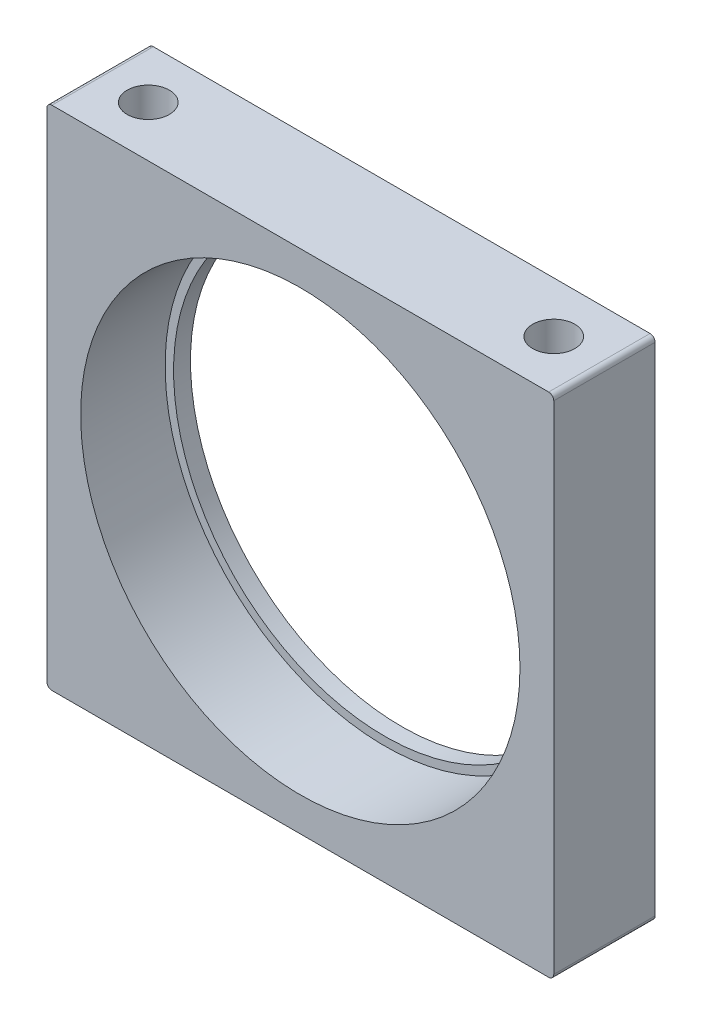
ISO-10303-21;
HEADER;
FILE_DESCRIPTION(('STEP AP214'),'2;1');
FILE_NAME('part.step','',(''),(''),'','','');
FILE_SCHEMA(('AUTOMOTIVE_DESIGN { 1 0 10303 214 1 1 1 1 }'));
ENDSEC;
DATA;
#1=APPLICATION_CONTEXT('core data for automotive mechanical design processes');
#2=APPLICATION_PROTOCOL_DEFINITION('international standard','automotive_design',2000,#1);
#3=PRODUCT_CONTEXT('',#1,'mechanical');
#4=PRODUCT('Part','Part','',(#3));
#5=PRODUCT_RELATED_PRODUCT_CATEGORY('part','',(#4));
#6=PRODUCT_DEFINITION_FORMATION('','',#4);
#7=PRODUCT_DEFINITION_CONTEXT('part definition',#1,'design');
#8=PRODUCT_DEFINITION('design','',#6,#7);
#9=PRODUCT_DEFINITION_SHAPE('','',#8);
#10=(LENGTH_UNIT() NAMED_UNIT(*) SI_UNIT(.MILLI.,.METRE.));
#11=(NAMED_UNIT(*) PLANE_ANGLE_UNIT() SI_UNIT($,.RADIAN.));
#12=(NAMED_UNIT(*) SI_UNIT($,.STERADIAN.) SOLID_ANGLE_UNIT());
#13=UNCERTAINTY_MEASURE_WITH_UNIT(LENGTH_MEASURE(1.E-05),#10,'distance_accuracy_value','');
#14=(GEOMETRIC_REPRESENTATION_CONTEXT(3) GLOBAL_UNCERTAINTY_ASSIGNED_CONTEXT((#13)) GLOBAL_UNIT_ASSIGNED_CONTEXT((#10,
#11,#12)) REPRESENTATION_CONTEXT('',''));
#15=CARTESIAN_POINT('',(0.,0.,0.));
#16=DIRECTION('',(0.,0.,1.));
#17=DIRECTION('',(1.,0.,0.));
#18=AXIS2_PLACEMENT_3D('',#15,#16,#17);
#19=CARTESIAN_POINT('',(15.,15.,6.));
#20=DIRECTION('',(0.,0.,-1.));
#21=DIRECTION('',(-1.,0.,0.));
#22=AXIS2_PLACEMENT_3D('',#19,#20,#21);
#23=CYLINDRICAL_SURFACE('',#22,12.5);
#24=CARTESIAN_POINT('',(15.,15.,0.));
#25=DIRECTION('',(0.,0.,1.));
#26=DIRECTION('',(1.,0.,0.));
#27=AXIS2_PLACEMENT_3D('',#24,#25,#26);
#28=CIRCLE('',#27,12.5);
#29=CARTESIAN_POINT('',(27.5,15.,0.));
#30=VERTEX_POINT('',#29);
#31=EDGE_CURVE('E164',#30,#30,#28,.T.);
#32=ORIENTED_EDGE('',*,*,#31,.F.);
#33=EDGE_LOOP('',(#32));
#34=FACE_BOUND('',#33,.T.);
#35=CARTESIAN_POINT('',(15.,15.,1.));
#36=DIRECTION('',(0.,0.,1.));
#37=DIRECTION('',(1.,0.,0.));
#38=AXIS2_PLACEMENT_3D('',#35,#36,#37);
#39=CIRCLE('',#38,12.5);
#40=CARTESIAN_POINT('',(27.5,15.,1.));
#41=VERTEX_POINT('',#40);
#42=EDGE_CURVE('E161',#41,#41,#39,.T.);
#43=ORIENTED_EDGE('',*,*,#42,.T.);
#44=EDGE_LOOP('',(#43));
#45=FACE_BOUND('',#44,.T.);
#46=ADVANCED_FACE('F38',(#34,#45),#23,.F.);
#47=CARTESIAN_POINT('',(0.,0.,6.));
#48=DIRECTION('',(0.,0.,-1.));
#49=DIRECTION('',(-1.,0.,0.));
#50=AXIS2_PLACEMENT_3D('',#47,#48,#49);
#51=PLANE('',#50);
#52=CARTESIAN_POINT('',(15.,15.,6.));
#53=DIRECTION('',(0.,0.,1.));
#54=DIRECTION('',(1.,0.,0.));
#55=AXIS2_PLACEMENT_3D('',#52,#53,#54);
#56=CIRCLE('',#55,13.);
#57=CARTESIAN_POINT('',(28.,15.,6.));
#58=VERTEX_POINT('',#57);
#59=EDGE_CURVE('E156',#58,#58,#56,.T.);
#60=ORIENTED_EDGE('',*,*,#59,.F.);
#61=EDGE_LOOP('',(#60));
#62=FACE_BOUND('',#61,.T.);
#63=DIRECTION('',(0.,-1.,0.));
#64=VECTOR('',#63,1.);
#65=CARTESIAN_POINT('',(0.,0.,6.));
#66=LINE('',#65,#64);
#67=CARTESIAN_POINT('',(0.,29.7,6.));
#68=VERTEX_POINT('',#67);
#69=CARTESIAN_POINT('',(0.,0.3,6.));
#70=VERTEX_POINT('',#69);
#71=EDGE_CURVE('E168',#68,#70,#66,.T.);
#72=ORIENTED_EDGE('',*,*,#71,.T.);
#73=CARTESIAN_POINT('',(0.3,0.3,6.));
#74=DIRECTION('',(0.,0.,-1.));
#75=DIRECTION('',(-1.,0.,0.));
#76=AXIS2_PLACEMENT_3D('',#73,#74,#75);
#77=CIRCLE('',#76,0.3);
#78=CARTESIAN_POINT('',(0.3,0.,6.));
#79=VERTEX_POINT('',#78);
#80=EDGE_CURVE('E222',#70,#79,#77,.F.);
#81=ORIENTED_EDGE('',*,*,#80,.T.);
#82=DIRECTION('',(1.,0.,0.));
#83=VECTOR('',#82,1.);
#84=CARTESIAN_POINT('',(0.,0.,6.));
#85=LINE('',#84,#83);
#86=CARTESIAN_POINT('',(29.7,0.,6.));
#87=VERTEX_POINT('',#86);
#88=EDGE_CURVE('E172',#79,#87,#85,.T.);
#89=ORIENTED_EDGE('',*,*,#88,.T.);
#90=CARTESIAN_POINT('',(29.7,0.3,6.));
#91=DIRECTION('',(0.,0.,-1.));
#92=DIRECTION('',(-1.,0.,0.));
#93=AXIS2_PLACEMENT_3D('',#90,#91,#92);
#94=CIRCLE('',#93,0.3);
#95=CARTESIAN_POINT('',(30.,0.3,6.));
#96=VERTEX_POINT('',#95);
#97=EDGE_CURVE('E220',#87,#96,#94,.F.);
#98=ORIENTED_EDGE('',*,*,#97,.T.);
#99=DIRECTION('',(0.,1.,0.));
#100=VECTOR('',#99,1.);
#101=CARTESIAN_POINT('',(30.,0.,6.));
#102=LINE('',#101,#100);
#103=CARTESIAN_POINT('',(30.,29.7,6.));
#104=VERTEX_POINT('',#103);
#105=EDGE_CURVE('E177',#96,#104,#102,.T.);
#106=ORIENTED_EDGE('',*,*,#105,.T.);
#107=CARTESIAN_POINT('',(29.7,29.7,6.));
#108=DIRECTION('',(0.,0.,-1.));
#109=DIRECTION('',(-1.,0.,0.));
#110=AXIS2_PLACEMENT_3D('',#107,#108,#109);
#111=CIRCLE('',#110,0.3);
#112=CARTESIAN_POINT('',(29.7,30.,6.));
#113=VERTEX_POINT('',#112);
#114=EDGE_CURVE('E58',#104,#113,#111,.F.);
#115=ORIENTED_EDGE('',*,*,#114,.T.);
#116=DIRECTION('',(-1.,0.,0.));
#117=VECTOR('',#116,1.);
#118=CARTESIAN_POINT('',(0.,30.,6.));
#119=LINE('',#118,#117);
#120=CARTESIAN_POINT('',(0.3,30.,6.));
#121=VERTEX_POINT('',#120);
#122=EDGE_CURVE('E180',#113,#121,#119,.T.);
#123=ORIENTED_EDGE('',*,*,#122,.T.);
#124=CARTESIAN_POINT('',(0.3,29.7,6.));
#125=DIRECTION('',(0.,0.,-1.));
#126=DIRECTION('',(-1.,0.,0.));
#127=AXIS2_PLACEMENT_3D('',#124,#125,#126);
#128=CIRCLE('',#127,0.3);
#129=EDGE_CURVE('E218',#121,#68,#128,.F.);
#130=ORIENTED_EDGE('',*,*,#129,.T.);
#131=EDGE_LOOP('',(#72,#81,#89,#98,#106,#115,#123,#130));
#132=FACE_BOUND('',#131,.T.);
#133=ADVANCED_FACE('F248',(#62,#132),#51,.F.);
#134=CARTESIAN_POINT('',(0.,0.,0.));
#135=DIRECTION('',(0.,0.,-1.));
#136=DIRECTION('',(-1.,0.,0.));
#137=AXIS2_PLACEMENT_3D('',#134,#135,#136);
#138=PLANE('',#137);
#139=DIRECTION('',(1.,0.,0.));
#140=VECTOR('',#139,1.);
#141=CARTESIAN_POINT('',(0.,0.,0.));
#142=LINE('',#141,#140);
#143=CARTESIAN_POINT('',(0.3,0.,0.));
#144=VERTEX_POINT('',#143);
#145=CARTESIAN_POINT('',(29.7,0.,0.));
#146=VERTEX_POINT('',#145);
#147=EDGE_CURVE('E187',#144,#146,#142,.T.);
#148=ORIENTED_EDGE('',*,*,#147,.F.);
#149=CARTESIAN_POINT('',(0.3,0.3,0.));
#150=DIRECTION('',(0.,0.,-1.));
#151=DIRECTION('',(-1.,0.,0.));
#152=AXIS2_PLACEMENT_3D('',#149,#150,#151);
#153=CIRCLE('',#152,0.3);
#154=CARTESIAN_POINT('',(0.,0.3,0.));
#155=VERTEX_POINT('',#154);
#156=EDGE_CURVE('E210',#144,#155,#153,.T.);
#157=ORIENTED_EDGE('',*,*,#156,.T.);
#158=DIRECTION('',(0.,-1.,0.));
#159=VECTOR('',#158,1.);
#160=CARTESIAN_POINT('',(0.,0.,0.));
#161=LINE('',#160,#159);
#162=CARTESIAN_POINT('',(0.,29.7,0.));
#163=VERTEX_POINT('',#162);
#164=EDGE_CURVE('E167',#163,#155,#161,.T.);
#165=ORIENTED_EDGE('',*,*,#164,.F.);
#166=CARTESIAN_POINT('',(0.3,29.7,0.));
#167=DIRECTION('',(0.,0.,-1.));
#168=DIRECTION('',(-1.,0.,0.));
#169=AXIS2_PLACEMENT_3D('',#166,#167,#168);
#170=CIRCLE('',#169,0.3);
#171=CARTESIAN_POINT('',(0.3,30.,0.));
#172=VERTEX_POINT('',#171);
#173=EDGE_CURVE('E206',#163,#172,#170,.T.);
#174=ORIENTED_EDGE('',*,*,#173,.T.);
#175=DIRECTION('',(-1.,0.,0.));
#176=VECTOR('',#175,1.);
#177=CARTESIAN_POINT('',(0.,30.,0.));
#178=LINE('',#177,#176);
#179=CARTESIAN_POINT('',(29.7,30.,0.));
#180=VERTEX_POINT('',#179);
#181=EDGE_CURVE('E173',#180,#172,#178,.T.);
#182=ORIENTED_EDGE('',*,*,#181,.F.);
#183=CARTESIAN_POINT('',(29.7,29.7,0.));
#184=DIRECTION('',(0.,0.,-1.));
#185=DIRECTION('',(-1.,0.,0.));
#186=AXIS2_PLACEMENT_3D('',#183,#184,#185);
#187=CIRCLE('',#186,0.3);
#188=CARTESIAN_POINT('',(30.,29.7,0.));
#189=VERTEX_POINT('',#188);
#190=EDGE_CURVE('E204',#180,#189,#187,.T.);
#191=ORIENTED_EDGE('',*,*,#190,.T.);
#192=DIRECTION('',(0.,1.,0.));
#193=VECTOR('',#192,1.);
#194=CARTESIAN_POINT('',(30.,0.,0.));
#195=LINE('',#194,#193);
#196=CARTESIAN_POINT('',(30.,0.3,0.));
#197=VERTEX_POINT('',#196);
#198=EDGE_CURVE('E191',#197,#189,#195,.T.);
#199=ORIENTED_EDGE('',*,*,#198,.F.);
#200=CARTESIAN_POINT('',(29.7,0.3,0.));
#201=DIRECTION('',(0.,0.,-1.));
#202=DIRECTION('',(-1.,0.,0.));
#203=AXIS2_PLACEMENT_3D('',#200,#201,#202);
#204=CIRCLE('',#203,0.3);
#205=EDGE_CURVE('E208',#197,#146,#204,.T.);
#206=ORIENTED_EDGE('',*,*,#205,.T.);
#207=EDGE_LOOP('',(#148,#157,#165,#174,#182,#191,#199,#206));
#208=FACE_BOUND('',#207,.T.);
#209=ORIENTED_EDGE('',*,*,#31,.T.);
#210=EDGE_LOOP('',(#209));
#211=FACE_BOUND('',#210,.T.);
#212=ADVANCED_FACE('F235',(#208,#211),#138,.T.);
#213=CARTESIAN_POINT('',(0.,0.,6.));
#214=DIRECTION('',(1.,0.,0.));
#215=DIRECTION('',(0.,0.,-1.));
#216=AXIS2_PLACEMENT_3D('',#213,#214,#215);
#217=PLANE('',#216);
#218=ORIENTED_EDGE('',*,*,#164,.T.);
#219=DIRECTION('',(0.,0.,-1.));
#220=VECTOR('',#219,1.);
#221=CARTESIAN_POINT('',(0.,0.3,6.));
#222=LINE('',#221,#220);
#223=EDGE_CURVE('E215',#155,#70,#222,.F.);
#224=ORIENTED_EDGE('',*,*,#223,.T.);
#225=ORIENTED_EDGE('',*,*,#71,.F.);
#226=DIRECTION('',(0.,0.,-1.));
#227=VECTOR('',#226,1.);
#228=CARTESIAN_POINT('',(0.,29.7,6.));
#229=LINE('',#228,#227);
#230=EDGE_CURVE('E212',#68,#163,#229,.T.);
#231=ORIENTED_EDGE('',*,*,#230,.T.);
#232=EDGE_LOOP('',(#218,#224,#225,#231));
#233=FACE_BOUND('',#232,.T.);
#234=ADVANCED_FACE('F245',(#233),#217,.F.);
#235=CARTESIAN_POINT('',(0.,0.,6.));
#236=DIRECTION('',(0.,1.,0.));
#237=DIRECTION('',(0.,0.,1.));
#238=AXIS2_PLACEMENT_3D('',#235,#236,#237);
#239=PLANE('',#238);
#240=CARTESIAN_POINT('',(3.,0.,3.));
#241=DIRECTION('',(0.,-1.,0.));
#242=DIRECTION('',(0.,0.,-1.));
#243=AXIS2_PLACEMENT_3D('',#240,#241,#242);
#244=CIRCLE('',#243,1.24999999999999);
#245=CARTESIAN_POINT('',(3.,0.,1.75000000000001));
#246=VERTEX_POINT('',#245);
#247=EDGE_CURVE('E125',#246,#246,#244,.T.);
#248=ORIENTED_EDGE('',*,*,#247,.F.);
#249=EDGE_LOOP('',(#248));
#250=FACE_BOUND('',#249,.T.);
#251=CARTESIAN_POINT('',(27.,0.,3.));
#252=DIRECTION('',(0.,-1.,0.));
#253=DIRECTION('',(0.,0.,-1.));
#254=AXIS2_PLACEMENT_3D('',#251,#252,#253);
#255=CIRCLE('',#254,1.24999999999999);
#256=CARTESIAN_POINT('',(27.,0.,1.75000000000001));
#257=VERTEX_POINT('',#256);
#258=EDGE_CURVE('E124',#257,#257,#255,.T.);
#259=ORIENTED_EDGE('',*,*,#258,.F.);
#260=EDGE_LOOP('',(#259));
#261=FACE_BOUND('',#260,.T.);
#262=ORIENTED_EDGE('',*,*,#88,.F.);
#263=DIRECTION('',(0.,0.,-1.));
#264=VECTOR('',#263,1.);
#265=CARTESIAN_POINT('',(0.3,0.,6.));
#266=LINE('',#265,#264);
#267=EDGE_CURVE('E201',#79,#144,#266,.T.);
#268=ORIENTED_EDGE('',*,*,#267,.T.);
#269=ORIENTED_EDGE('',*,*,#147,.T.);
#270=DIRECTION('',(0.,0.,-1.));
#271=VECTOR('',#270,1.);
#272=CARTESIAN_POINT('',(29.7,0.,6.));
#273=LINE('',#272,#271);
#274=EDGE_CURVE('E183',#146,#87,#273,.F.);
#275=ORIENTED_EDGE('',*,*,#274,.T.);
#276=EDGE_LOOP('',(#262,#268,#269,#275));
#277=FACE_BOUND('',#276,.T.);
#278=ADVANCED_FACE('F254',(#250,#261,#277),#239,.F.);
#279=CARTESIAN_POINT('',(30.,0.,6.));
#280=DIRECTION('',(-1.,0.,0.));
#281=DIRECTION('',(0.,0.,1.));
#282=AXIS2_PLACEMENT_3D('',#279,#280,#281);
#283=PLANE('',#282);
#284=ORIENTED_EDGE('',*,*,#105,.F.);
#285=DIRECTION('',(0.,0.,-1.));
#286=VECTOR('',#285,1.);
#287=CARTESIAN_POINT('',(30.,0.3,6.));
#288=LINE('',#287,#286);
#289=EDGE_CURVE('E226',#96,#197,#288,.T.);
#290=ORIENTED_EDGE('',*,*,#289,.T.);
#291=ORIENTED_EDGE('',*,*,#198,.T.);
#292=DIRECTION('',(0.,0.,-1.));
#293=VECTOR('',#292,1.);
#294=CARTESIAN_POINT('',(30.,29.7,6.));
#295=LINE('',#294,#293);
#296=EDGE_CURVE('E224',#189,#104,#295,.F.);
#297=ORIENTED_EDGE('',*,*,#296,.T.);
#298=EDGE_LOOP('',(#284,#290,#291,#297));
#299=FACE_BOUND('',#298,.T.);
#300=ADVANCED_FACE('F262',(#299),#283,.F.);
#301=CARTESIAN_POINT('',(0.,30.,6.));
#302=DIRECTION('',(0.,-1.,0.));
#303=DIRECTION('',(0.,0.,-1.));
#304=AXIS2_PLACEMENT_3D('',#301,#302,#303);
#305=PLANE('',#304);
#306=CARTESIAN_POINT('',(3.,30.,3.));
#307=DIRECTION('',(0.,1.,0.));
#308=DIRECTION('',(0.,0.,1.));
#309=AXIS2_PLACEMENT_3D('',#306,#307,#308);
#310=CIRCLE('',#309,1.24999999999999);
#311=CARTESIAN_POINT('',(3.,30.,4.24999999999999));
#312=VERTEX_POINT('',#311);
#313=EDGE_CURVE('E140',#312,#312,#310,.T.);
#314=ORIENTED_EDGE('',*,*,#313,.F.);
#315=EDGE_LOOP('',(#314));
#316=FACE_BOUND('',#315,.T.);
#317=CARTESIAN_POINT('',(27.,30.,3.));
#318=DIRECTION('',(0.,1.,0.));
#319=DIRECTION('',(0.,0.,1.));
#320=AXIS2_PLACEMENT_3D('',#317,#318,#319);
#321=CIRCLE('',#320,1.24999999999999);
#322=CARTESIAN_POINT('',(27.,30.,4.24999999999999));
#323=VERTEX_POINT('',#322);
#324=EDGE_CURVE('E148',#323,#323,#321,.T.);
#325=ORIENTED_EDGE('',*,*,#324,.F.);
#326=EDGE_LOOP('',(#325));
#327=FACE_BOUND('',#326,.T.);
#328=ORIENTED_EDGE('',*,*,#181,.T.);
#329=DIRECTION('',(0.,0.,-1.));
#330=VECTOR('',#329,1.);
#331=CARTESIAN_POINT('',(0.3,30.,6.));
#332=LINE('',#331,#330);
#333=EDGE_CURVE('E12',#172,#121,#332,.F.);
#334=ORIENTED_EDGE('',*,*,#333,.T.);
#335=ORIENTED_EDGE('',*,*,#122,.F.);
#336=DIRECTION('',(0.,0.,-1.));
#337=VECTOR('',#336,1.);
#338=CARTESIAN_POINT('',(29.7,30.,6.));
#339=LINE('',#338,#337);
#340=EDGE_CURVE('E46',#113,#180,#339,.T.);
#341=ORIENTED_EDGE('',*,*,#340,.T.);
#342=EDGE_LOOP('',(#328,#334,#335,#341));
#343=FACE_BOUND('',#342,.T.);
#344=ADVANCED_FACE('F231',(#316,#327,#343),#305,.F.);
#345=CARTESIAN_POINT('',(15.,15.,1.));
#346=DIRECTION('',(0.,0.,1.));
#347=DIRECTION('',(1.,0.,0.));
#348=AXIS2_PLACEMENT_3D('',#345,#346,#347);
#349=CYLINDRICAL_SURFACE('',#348,13.);
#350=CARTESIAN_POINT('',(15.,15.,1.));
#351=DIRECTION('',(0.,0.,1.));
#352=DIRECTION('',(1.,0.,0.));
#353=AXIS2_PLACEMENT_3D('',#350,#351,#352);
#354=CIRCLE('',#353,13.);
#355=CARTESIAN_POINT('',(28.,15.,1.));
#356=VERTEX_POINT('',#355);
#357=EDGE_CURVE('E157',#356,#356,#354,.T.);
#358=ORIENTED_EDGE('',*,*,#357,.F.);
#359=EDGE_LOOP('',(#358));
#360=FACE_BOUND('',#359,.T.);
#361=ORIENTED_EDGE('',*,*,#59,.T.);
#362=EDGE_LOOP('',(#361));
#363=FACE_BOUND('',#362,.T.);
#364=ADVANCED_FACE('F279',(#360,#363),#349,.F.);
#365=CARTESIAN_POINT('',(15.,15.,1.));
#366=DIRECTION('',(0.,0.,1.));
#367=DIRECTION('',(1.,0.,0.));
#368=AXIS2_PLACEMENT_3D('',#365,#366,#367);
#369=PLANE('',#368);
#370=ORIENTED_EDGE('',*,*,#42,.F.);
#371=EDGE_LOOP('',(#370));
#372=FACE_BOUND('',#371,.T.);
#373=ORIENTED_EDGE('',*,*,#357,.T.);
#374=EDGE_LOOP('',(#373));
#375=FACE_BOUND('',#374,.T.);
#376=ADVANCED_FACE('F391',(#372,#375),#369,.T.);
#377=CARTESIAN_POINT('',(27.,24.,3.));
#378=DIRECTION('',(0.,1.,0.));
#379=DIRECTION('',(0.,0.,1.));
#380=AXIS2_PLACEMENT_3D('',#377,#378,#379);
#381=CONICAL_SURFACE('',#380,1.24999999999999,1.02974425867665);
#382=CARTESIAN_POINT('',(27.,23.2489242262155,3.));
#383=VERTEX_POINT('',#382);
#384=VERTEX_LOOP('',#383);
#385=FACE_BOUND('',#384,.T.);
#386=CARTESIAN_POINT('',(27.,24.,3.));
#387=DIRECTION('',(0.,1.,0.));
#388=DIRECTION('',(0.,0.,1.));
#389=AXIS2_PLACEMENT_3D('',#386,#387,#388);
#390=CIRCLE('',#389,1.24999999999999);
#391=CARTESIAN_POINT('',(27.,24.,4.24999999999999));
#392=VERTEX_POINT('',#391);
#393=EDGE_CURVE('E152',#392,#392,#390,.T.);
#394=ORIENTED_EDGE('',*,*,#393,.T.);
#395=EDGE_LOOP('',(#394));
#396=FACE_BOUND('',#395,.T.);
#397=ADVANCED_FACE('F381',(#385,#396),#381,.F.);
#398=CARTESIAN_POINT('',(27.,30.,3.));
#399=DIRECTION('',(0.,1.,0.));
#400=DIRECTION('',(0.,0.,1.));
#401=AXIS2_PLACEMENT_3D('',#398,#399,#400);
#402=CYLINDRICAL_SURFACE('',#401,1.24999999999999);
#403=ORIENTED_EDGE('',*,*,#393,.F.);
#404=EDGE_LOOP('',(#403));
#405=FACE_BOUND('',#404,.T.);
#406=ORIENTED_EDGE('',*,*,#324,.T.);
#407=EDGE_LOOP('',(#406));
#408=FACE_BOUND('',#407,.T.);
#409=ADVANCED_FACE('F371',(#405,#408),#402,.F.);
#410=CARTESIAN_POINT('',(3.,24.,3.));
#411=DIRECTION('',(0.,1.,0.));
#412=DIRECTION('',(0.,0.,1.));
#413=AXIS2_PLACEMENT_3D('',#410,#411,#412);
#414=CONICAL_SURFACE('',#413,1.24999999999999,1.02974425867665);
#415=CARTESIAN_POINT('',(3.,23.2489242262155,3.));
#416=VERTEX_POINT('',#415);
#417=VERTEX_LOOP('',#416);
#418=FACE_BOUND('',#417,.T.);
#419=CARTESIAN_POINT('',(3.,24.,3.));
#420=DIRECTION('',(0.,1.,0.));
#421=DIRECTION('',(0.,0.,1.));
#422=AXIS2_PLACEMENT_3D('',#419,#420,#421);
#423=CIRCLE('',#422,1.24999999999999);
#424=CARTESIAN_POINT('',(3.,24.,4.24999999999999));
#425=VERTEX_POINT('',#424);
#426=EDGE_CURVE('E144',#425,#425,#423,.T.);
#427=ORIENTED_EDGE('',*,*,#426,.T.);
#428=EDGE_LOOP('',(#427));
#429=FACE_BOUND('',#428,.T.);
#430=ADVANCED_FACE('F361',(#418,#429),#414,.F.);
#431=CARTESIAN_POINT('',(3.,30.,3.));
#432=DIRECTION('',(0.,1.,0.));
#433=DIRECTION('',(0.,0.,1.));
#434=AXIS2_PLACEMENT_3D('',#431,#432,#433);
#435=CYLINDRICAL_SURFACE('',#434,1.24999999999999);
#436=ORIENTED_EDGE('',*,*,#426,.F.);
#437=EDGE_LOOP('',(#436));
#438=FACE_BOUND('',#437,.T.);
#439=ORIENTED_EDGE('',*,*,#313,.T.);
#440=EDGE_LOOP('',(#439));
#441=FACE_BOUND('',#440,.T.);
#442=ADVANCED_FACE('F351',(#438,#441),#435,.F.);
#443=CARTESIAN_POINT('',(27.,6.00000000000001,3.));
#444=DIRECTION('',(0.,-1.,0.));
#445=DIRECTION('',(0.,0.,-1.));
#446=AXIS2_PLACEMENT_3D('',#443,#444,#445);
#447=CONICAL_SURFACE('',#446,1.24999999999999,1.02974425867665);
#448=CARTESIAN_POINT('',(27.,6.75107577378445,3.));
#449=VERTEX_POINT('',#448);
#450=VERTEX_LOOP('',#449);
#451=FACE_BOUND('',#450,.T.);
#452=CARTESIAN_POINT('',(27.,6.00000000000001,3.));
#453=DIRECTION('',(0.,-1.,0.));
#454=DIRECTION('',(0.,0.,-1.));
#455=AXIS2_PLACEMENT_3D('',#452,#453,#454);
#456=CIRCLE('',#455,1.24999999999999);
#457=CARTESIAN_POINT('',(27.,6.00000000000001,1.75000000000001));
#458=VERTEX_POINT('',#457);
#459=EDGE_CURVE('E131',#458,#458,#456,.T.);
#460=ORIENTED_EDGE('',*,*,#459,.T.);
#461=EDGE_LOOP('',(#460));
#462=FACE_BOUND('',#461,.T.);
#463=ADVANCED_FACE('F341',(#451,#462),#447,.F.);
#464=CARTESIAN_POINT('',(27.,0.,3.));
#465=DIRECTION('',(0.,-1.,0.));
#466=DIRECTION('',(0.,0.,-1.));
#467=AXIS2_PLACEMENT_3D('',#464,#465,#466);
#468=CYLINDRICAL_SURFACE('',#467,1.24999999999999);
#469=ORIENTED_EDGE('',*,*,#459,.F.);
#470=EDGE_LOOP('',(#469));
#471=FACE_BOUND('',#470,.T.);
#472=ORIENTED_EDGE('',*,*,#258,.T.);
#473=EDGE_LOOP('',(#472));
#474=FACE_BOUND('',#473,.T.);
#475=ADVANCED_FACE('F117',(#471,#474),#468,.F.);
#476=CARTESIAN_POINT('',(3.,6.00000000000001,3.));
#477=DIRECTION('',(0.,-1.,0.));
#478=DIRECTION('',(0.,0.,-1.));
#479=AXIS2_PLACEMENT_3D('',#476,#477,#478);
#480=CONICAL_SURFACE('',#479,1.24999999999999,1.02974425867665);
#481=CARTESIAN_POINT('',(3.,6.75107577378445,3.));
#482=VERTEX_POINT('',#481);
#483=VERTEX_LOOP('',#482);
#484=FACE_BOUND('',#483,.T.);
#485=CARTESIAN_POINT('',(3.,6.00000000000001,3.));
#486=DIRECTION('',(0.,-1.,0.));
#487=DIRECTION('',(0.,0.,-1.));
#488=AXIS2_PLACEMENT_3D('',#485,#486,#487);
#489=CIRCLE('',#488,1.24999999999999);
#490=CARTESIAN_POINT('',(3.,6.00000000000001,1.75000000000001));
#491=VERTEX_POINT('',#490);
#492=EDGE_CURVE('E121',#491,#491,#489,.T.);
#493=ORIENTED_EDGE('',*,*,#492,.T.);
#494=EDGE_LOOP('',(#493));
#495=FACE_BOUND('',#494,.T.);
#496=ADVANCED_FACE('F113',(#484,#495),#480,.F.);
#497=CARTESIAN_POINT('',(3.,0.,3.));
#498=DIRECTION('',(0.,-1.,0.));
#499=DIRECTION('',(0.,0.,-1.));
#500=AXIS2_PLACEMENT_3D('',#497,#498,#499);
#501=CYLINDRICAL_SURFACE('',#500,1.24999999999999);
#502=ORIENTED_EDGE('',*,*,#492,.F.);
#503=EDGE_LOOP('',(#502));
#504=FACE_BOUND('',#503,.T.);
#505=ORIENTED_EDGE('',*,*,#247,.T.);
#506=EDGE_LOOP('',(#505));
#507=FACE_BOUND('',#506,.T.);
#508=ADVANCED_FACE('F116',(#504,#507),#501,.F.);
#509=CARTESIAN_POINT('',(0.3,0.3,6.));
#510=DIRECTION('',(0.,0.,-1.));
#511=DIRECTION('',(-1.,0.,0.));
#512=AXIS2_PLACEMENT_3D('',#509,#510,#511);
#513=CYLINDRICAL_SURFACE('',#512,0.3);
#514=ORIENTED_EDGE('',*,*,#80,.F.);
#515=ORIENTED_EDGE('',*,*,#223,.F.);
#516=ORIENTED_EDGE('',*,*,#156,.F.);
#517=ORIENTED_EDGE('',*,*,#267,.F.);
#518=EDGE_LOOP('',(#514,#515,#516,#517));
#519=FACE_BOUND('',#518,.T.);
#520=ADVANCED_FACE('F252',(#519),#513,.T.);
#521=CARTESIAN_POINT('',(29.7,0.3,6.));
#522=DIRECTION('',(0.,0.,-1.));
#523=DIRECTION('',(-1.,0.,0.));
#524=AXIS2_PLACEMENT_3D('',#521,#522,#523);
#525=CYLINDRICAL_SURFACE('',#524,0.3);
#526=ORIENTED_EDGE('',*,*,#97,.F.);
#527=ORIENTED_EDGE('',*,*,#274,.F.);
#528=ORIENTED_EDGE('',*,*,#205,.F.);
#529=ORIENTED_EDGE('',*,*,#289,.F.);
#530=EDGE_LOOP('',(#526,#527,#528,#529));
#531=FACE_BOUND('',#530,.T.);
#532=ADVANCED_FACE('F259',(#531),#525,.T.);
#533=CARTESIAN_POINT('',(0.3,29.7,6.));
#534=DIRECTION('',(0.,0.,-1.));
#535=DIRECTION('',(-1.,0.,0.));
#536=AXIS2_PLACEMENT_3D('',#533,#534,#535);
#537=CYLINDRICAL_SURFACE('',#536,0.3);
#538=ORIENTED_EDGE('',*,*,#129,.F.);
#539=ORIENTED_EDGE('',*,*,#333,.F.);
#540=ORIENTED_EDGE('',*,*,#173,.F.);
#541=ORIENTED_EDGE('',*,*,#230,.F.);
#542=EDGE_LOOP('',(#538,#539,#540,#541));
#543=FACE_BOUND('',#542,.T.);
#544=ADVANCED_FACE('F242',(#543),#537,.T.);
#545=CARTESIAN_POINT('',(29.7,29.7,6.));
#546=DIRECTION('',(0.,0.,-1.));
#547=DIRECTION('',(-1.,0.,0.));
#548=AXIS2_PLACEMENT_3D('',#545,#546,#547);
#549=CYLINDRICAL_SURFACE('',#548,0.3);
#550=ORIENTED_EDGE('',*,*,#114,.F.);
#551=ORIENTED_EDGE('',*,*,#296,.F.);
#552=ORIENTED_EDGE('',*,*,#190,.F.);
#553=ORIENTED_EDGE('',*,*,#340,.F.);
#554=EDGE_LOOP('',(#550,#551,#552,#553));
#555=FACE_BOUND('',#554,.T.);
#556=ADVANCED_FACE('F40',(#555),#549,.T.);
#557=CLOSED_SHELL('',(#46,#133,#212,#234,#278,#300,#344,#364,#376,#397,#409,#430,#442,#463,#475,
#496,#508,#520,#532,#544,#556));
#558=MANIFOLD_SOLID_BREP('B2',#557);
#559=ADVANCED_BREP_SHAPE_REPRESENTATION('',(#18,#558),#14);
#560=SHAPE_DEFINITION_REPRESENTATION(#9,#559);
ENDSEC;
END-ISO-10303-21;
